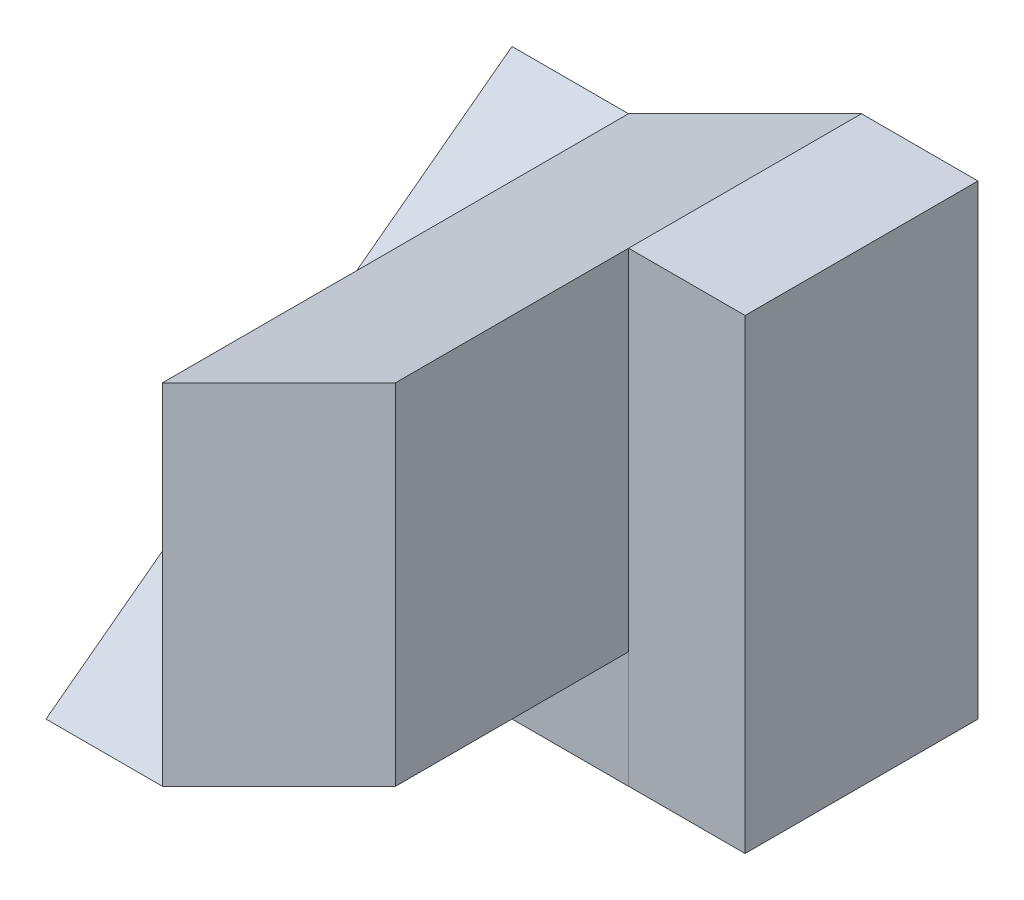
ISO-10303-21;
HEADER;
FILE_DESCRIPTION(('STEP AP214'),'2;1');
FILE_NAME('part.step','',(''),(''),'','','');
FILE_SCHEMA(('AUTOMOTIVE_DESIGN { 1 0 10303 214 1 1 1 1 }'));
ENDSEC;
DATA;
#1=APPLICATION_CONTEXT('core data for automotive mechanical design processes');
#2=APPLICATION_PROTOCOL_DEFINITION('international standard','automotive_design',2000,#1);
#3=PRODUCT_CONTEXT('',#1,'mechanical');
#4=PRODUCT('Part','Part','',(#3));
#5=PRODUCT_RELATED_PRODUCT_CATEGORY('part','',(#4));
#6=PRODUCT_DEFINITION_FORMATION('','',#4);
#7=PRODUCT_DEFINITION_CONTEXT('part definition',#1,'design');
#8=PRODUCT_DEFINITION('design','',#6,#7);
#9=PRODUCT_DEFINITION_SHAPE('','',#8);
#10=(LENGTH_UNIT() NAMED_UNIT(*) SI_UNIT(.MILLI.,.METRE.));
#11=(NAMED_UNIT(*) PLANE_ANGLE_UNIT() SI_UNIT($,.RADIAN.));
#12=(NAMED_UNIT(*) SI_UNIT($,.STERADIAN.) SOLID_ANGLE_UNIT());
#13=UNCERTAINTY_MEASURE_WITH_UNIT(LENGTH_MEASURE(1.E-05),#10,'distance_accuracy_value','');
#14=(GEOMETRIC_REPRESENTATION_CONTEXT(3) GLOBAL_UNCERTAINTY_ASSIGNED_CONTEXT((#13)) GLOBAL_UNIT_ASSIGNED_CONTEXT((#10,
#11,#12)) REPRESENTATION_CONTEXT('',''));
#15=CARTESIAN_POINT('',(0.,0.,0.));
#16=DIRECTION('',(0.,0.,1.));
#17=DIRECTION('',(1.,0.,0.));
#18=AXIS2_PLACEMENT_3D('',#15,#16,#17);
#19=CARTESIAN_POINT('',(3.,0.,0.));
#20=DIRECTION('',(-1.,0.,0.));
#21=DIRECTION('',(0.,0.,1.));
#22=AXIS2_PLACEMENT_3D('',#19,#20,#21);
#23=PLANE('',#22);
#24=DIRECTION('',(0.,-1.,0.));
#25=VECTOR('',#24,1.);
#26=CARTESIAN_POINT('',(3.,0.,1.99922298992306));
#27=LINE('',#26,#25);
#28=CARTESIAN_POINT('',(3.,4.,1.99922298992306));
#29=VERTEX_POINT('',#28);
#30=CARTESIAN_POINT('',(3.,0.,1.99922298992306));
#31=VERTEX_POINT('',#30);
#32=EDGE_CURVE('E50',#29,#31,#27,.T.);
#33=ORIENTED_EDGE('',*,*,#32,.F.);
#34=DIRECTION('',(0.,0.,1.));
#35=VECTOR('',#34,1.);
#36=CARTESIAN_POINT('',(3.,4.,4.));
#37=LINE('',#36,#35);
#38=CARTESIAN_POINT('',(3.,4.,4.));
#39=VERTEX_POINT('',#38);
#40=EDGE_CURVE('E167',#29,#39,#37,.T.);
#41=ORIENTED_EDGE('',*,*,#40,.T.);
#42=DIRECTION('',(0.,-1.,0.));
#43=VECTOR('',#42,1.);
#44=CARTESIAN_POINT('',(3.,0.,4.));
#45=LINE('',#44,#43);
#46=CARTESIAN_POINT('',(3.,0.999999999999999,4.));
#47=VERTEX_POINT('',#46);
#48=EDGE_CURVE('E155',#39,#47,#45,.T.);
#49=ORIENTED_EDGE('',*,*,#48,.T.);
#50=DIRECTION('',(0.,0.,1.));
#51=VECTOR('',#50,1.);
#52=CARTESIAN_POINT('',(3.,0.999999999999999,2.));
#53=LINE('',#52,#51);
#54=CARTESIAN_POINT('',(3.,0.999999999999999,2.));
#55=VERTEX_POINT('',#54);
#56=EDGE_CURVE('E145',#55,#47,#53,.T.);
#57=ORIENTED_EDGE('',*,*,#56,.F.);
#58=DIRECTION('',(0.,1.,0.));
#59=VECTOR('',#58,1.);
#60=CARTESIAN_POINT('',(3.,0.999999999999999,2.));
#61=LINE('',#60,#59);
#62=CARTESIAN_POINT('',(3.,0.,2.));
#63=VERTEX_POINT('',#62);
#64=EDGE_CURVE('E141',#63,#55,#61,.T.);
#65=ORIENTED_EDGE('',*,*,#64,.F.);
#66=DIRECTION('',(0.,0.,-1.));
#67=VECTOR('',#66,1.);
#68=CARTESIAN_POINT('',(3.,0.,4.));
#69=LINE('',#68,#67);
#70=EDGE_CURVE('E158',#63,#31,#69,.T.);
#71=ORIENTED_EDGE('',*,*,#70,.T.);
#72=EDGE_LOOP('',(#33,#41,#49,#57,#65,#71));
#73=FACE_BOUND('',#72,.T.);
#74=ADVANCED_FACE('F33',(#73),#23,.F.);
#75=CARTESIAN_POINT('',(1.,0.,4.));
#76=DIRECTION('',(0.,1.,0.));
#77=DIRECTION('',(0.,0.,1.));
#78=AXIS2_PLACEMENT_3D('',#75,#76,#77);
#79=PLANE('',#78);
#80=DIRECTION('',(1.,0.,0.));
#81=VECTOR('',#80,1.);
#82=CARTESIAN_POINT('',(3.,0.,2.));
#83=LINE('',#82,#81);
#84=CARTESIAN_POINT('',(1.,0.,2.));
#85=VERTEX_POINT('',#84);
#86=EDGE_CURVE('E58',#85,#63,#83,.T.);
#87=ORIENTED_EDGE('',*,*,#86,.F.);
#88=DIRECTION('',(0.,0.,1.));
#89=VECTOR('',#88,1.);
#90=CARTESIAN_POINT('',(1.,0.,2.));
#91=LINE('',#90,#89);
#92=CARTESIAN_POINT('',(1.,0.,4.));
#93=VERTEX_POINT('',#92);
#94=EDGE_CURVE('E147',#85,#93,#91,.T.);
#95=ORIENTED_EDGE('',*,*,#94,.T.);
#96=DIRECTION('',(-1.,0.,0.));
#97=VECTOR('',#96,1.);
#98=CARTESIAN_POINT('',(1.,0.,4.));
#99=LINE('',#98,#97);
#100=CARTESIAN_POINT('',(0.,0.,4.));
#101=VERTEX_POINT('',#100);
#102=EDGE_CURVE('E199',#93,#101,#99,.T.);
#103=ORIENTED_EDGE('',*,*,#102,.T.);
#104=DIRECTION('',(0.,0.,-1.));
#105=VECTOR('',#104,1.);
#106=CARTESIAN_POINT('',(0.,0.,4.));
#107=LINE('',#106,#105);
#108=CARTESIAN_POINT('',(0.,0.,0.));
#109=VERTEX_POINT('',#108);
#110=EDGE_CURVE('E173',#101,#109,#107,.T.);
#111=ORIENTED_EDGE('',*,*,#110,.T.);
#112=DIRECTION('',(-1.,0.,0.));
#113=VECTOR('',#112,1.);
#114=CARTESIAN_POINT('',(1.,0.,0.));
#115=LINE('',#114,#113);
#116=CARTESIAN_POINT('',(4.,0.,0.));
#117=VERTEX_POINT('',#116);
#118=EDGE_CURVE('E11',#117,#109,#115,.T.);
#119=ORIENTED_EDGE('',*,*,#118,.F.);
#120=DIRECTION('',(0.,0.,-1.));
#121=VECTOR('',#120,1.);
#122=CARTESIAN_POINT('',(4.,0.,0.));
#123=LINE('',#122,#121);
#124=CARTESIAN_POINT('',(4.,0.,1.99922298992306));
#125=VERTEX_POINT('',#124);
#126=EDGE_CURVE('E124',#125,#117,#123,.T.);
#127=ORIENTED_EDGE('',*,*,#126,.F.);
#128=DIRECTION('',(-1.,0.,0.));
#129=VECTOR('',#128,1.);
#130=CARTESIAN_POINT('',(4.,0.,1.99922298992306));
#131=LINE('',#130,#129);
#132=EDGE_CURVE('E135',#125,#31,#131,.T.);
#133=ORIENTED_EDGE('',*,*,#132,.T.);
#134=ORIENTED_EDGE('',*,*,#70,.F.);
#135=EDGE_LOOP('',(#87,#95,#103,#111,#119,#127,#133,#134));
#136=FACE_BOUND('',#135,.T.);
#137=ADVANCED_FACE('F35',(#136),#79,.F.);
#138=CARTESIAN_POINT('',(1.,0.,0.));
#139=DIRECTION('',(0.,0.,1.));
#140=DIRECTION('',(1.,0.,0.));
#141=AXIS2_PLACEMENT_3D('',#138,#139,#140);
#142=PLANE('',#141);
#143=DIRECTION('',(-1.,0.,0.));
#144=VECTOR('',#143,1.);
#145=CARTESIAN_POINT('',(1.,3.,0.));
#146=LINE('',#145,#144);
#147=CARTESIAN_POINT('',(1.,3.,0.));
#148=VERTEX_POINT('',#147);
#149=CARTESIAN_POINT('',(0.,3.,0.));
#150=VERTEX_POINT('',#149);
#151=EDGE_CURVE('E42',#148,#150,#146,.T.);
#152=ORIENTED_EDGE('',*,*,#151,.F.);
#153=DIRECTION('',(0.894427190999916,0.447213595499958,0.));
#154=VECTOR('',#153,1.);
#155=CARTESIAN_POINT('',(1.,3.,0.));
#156=LINE('',#155,#154);
#157=CARTESIAN_POINT('',(3.,4.,0.));
#158=VERTEX_POINT('',#157);
#159=EDGE_CURVE('E131',#148,#158,#156,.T.);
#160=ORIENTED_EDGE('',*,*,#159,.T.);
#161=DIRECTION('',(-1.,0.,0.));
#162=VECTOR('',#161,1.);
#163=CARTESIAN_POINT('',(4.,4.,0.));
#164=LINE('',#163,#162);
#165=CARTESIAN_POINT('',(4.,4.,0.));
#166=VERTEX_POINT('',#165);
#167=EDGE_CURVE('E112',#166,#158,#164,.T.);
#168=ORIENTED_EDGE('',*,*,#167,.F.);
#169=DIRECTION('',(0.,1.,0.));
#170=VECTOR('',#169,1.);
#171=CARTESIAN_POINT('',(4.,0.,0.));
#172=LINE('',#171,#170);
#173=EDGE_CURVE('E118',#117,#166,#172,.T.);
#174=ORIENTED_EDGE('',*,*,#173,.F.);
#175=ORIENTED_EDGE('',*,*,#118,.T.);
#176=DIRECTION('',(0.,1.,0.));
#177=VECTOR('',#176,1.);
#178=CARTESIAN_POINT('',(0.,0.,0.));
#179=LINE('',#178,#177);
#180=EDGE_CURVE('E187',#109,#150,#179,.T.);
#181=ORIENTED_EDGE('',*,*,#180,.T.);
#182=EDGE_LOOP('',(#152,#160,#168,#174,#175,#181));
#183=FACE_BOUND('',#182,.T.);
#184=ADVANCED_FACE('F129',(#183),#142,.F.);
#185=CARTESIAN_POINT('',(1.,3.,0.));
#186=DIRECTION('',(0.,-0.8,-0.6));
#187=DIRECTION('',(0.,0.6,-0.8));
#188=AXIS2_PLACEMENT_3D('',#185,#186,#187);
#189=PLANE('',#188);
#190=DIRECTION('',(0.,-0.6,0.8));
#191=VECTOR('',#190,1.);
#192=CARTESIAN_POINT('',(0.,3.,0.));
#193=LINE('',#192,#191);
#194=EDGE_CURVE('E192',#150,#101,#193,.T.);
#195=ORIENTED_EDGE('',*,*,#194,.T.);
#196=ORIENTED_EDGE('',*,*,#102,.F.);
#197=DIRECTION('',(0.,-0.6,0.8));
#198=VECTOR('',#197,1.);
#199=CARTESIAN_POINT('',(1.,3.,0.));
#200=LINE('',#199,#198);
#201=EDGE_CURVE('E198',#148,#93,#200,.T.);
#202=ORIENTED_EDGE('',*,*,#201,.F.);
#203=ORIENTED_EDGE('',*,*,#151,.T.);
#204=EDGE_LOOP('',(#195,#196,#202,#203));
#205=FACE_BOUND('',#204,.T.);
#206=ADVANCED_FACE('F195',(#205),#189,.F.);
#207=CARTESIAN_POINT('',(0.,0.,0.));
#208=DIRECTION('',(1.,0.,0.));
#209=DIRECTION('',(0.,0.,-1.));
#210=AXIS2_PLACEMENT_3D('',#207,#208,#209);
#211=PLANE('',#210);
#212=ORIENTED_EDGE('',*,*,#110,.F.);
#213=ORIENTED_EDGE('',*,*,#194,.F.);
#214=ORIENTED_EDGE('',*,*,#180,.F.);
#215=EDGE_LOOP('',(#212,#213,#214));
#216=FACE_BOUND('',#215,.T.);
#217=ADVANCED_FACE('F201',(#216),#211,.F.);
#218=CARTESIAN_POINT('',(3.,0.,4.));
#219=DIRECTION('',(0.,0.,-1.));
#220=DIRECTION('',(-1.,0.,0.));
#221=AXIS2_PLACEMENT_3D('',#218,#219,#220);
#222=PLANE('',#221);
#223=DIRECTION('',(0.,-1.,0.));
#224=VECTOR('',#223,1.);
#225=CARTESIAN_POINT('',(1.,0.,4.));
#226=LINE('',#225,#224);
#227=CARTESIAN_POINT('',(1.,3.,4.));
#228=VERTEX_POINT('',#227);
#229=EDGE_CURVE('E159',#228,#93,#226,.T.);
#230=ORIENTED_EDGE('',*,*,#229,.T.);
#231=DIRECTION('',(-0.894427190999916,-0.447213595499958,0.));
#232=VECTOR('',#231,1.);
#233=CARTESIAN_POINT('',(1.,0.,4.));
#234=LINE('',#233,#232);
#235=EDGE_CURVE('E133',#47,#93,#234,.T.);
#236=ORIENTED_EDGE('',*,*,#235,.F.);
#237=ORIENTED_EDGE('',*,*,#48,.F.);
#238=DIRECTION('',(0.894427190999916,0.447213595499958,0.));
#239=VECTOR('',#238,1.);
#240=CARTESIAN_POINT('',(3.,4.,4.));
#241=LINE('',#240,#239);
#242=EDGE_CURVE('E150',#228,#39,#241,.T.);
#243=ORIENTED_EDGE('',*,*,#242,.F.);
#244=EDGE_LOOP('',(#230,#236,#237,#243));
#245=FACE_BOUND('',#244,.T.);
#246=ADVANCED_FACE('F218',(#245),#222,.F.);
#247=CARTESIAN_POINT('',(1.,0.,0.));
#248=DIRECTION('',(-1.,0.,0.));
#249=DIRECTION('',(0.,0.,1.));
#250=AXIS2_PLACEMENT_3D('',#247,#248,#249);
#251=PLANE('',#250);
#252=DIRECTION('',(0.,0.,1.));
#253=VECTOR('',#252,1.);
#254=CARTESIAN_POINT('',(1.,3.,2.));
#255=LINE('',#254,#253);
#256=EDGE_CURVE('E154',#148,#228,#255,.T.);
#257=ORIENTED_EDGE('',*,*,#256,.F.);
#258=ORIENTED_EDGE('',*,*,#201,.T.);
#259=ORIENTED_EDGE('',*,*,#229,.F.);
#260=EDGE_LOOP('',(#257,#258,#259));
#261=FACE_BOUND('',#260,.T.);
#262=ADVANCED_FACE('F221',(#261),#251,.T.);
#263=CARTESIAN_POINT('',(3.,4.,2.));
#264=DIRECTION('',(0.447213595499958,-0.894427190999916,0.));
#265=DIRECTION('',(0.894427190999916,0.447213595499958,0.));
#266=AXIS2_PLACEMENT_3D('',#263,#264,#265);
#267=PLANE('',#266);
#268=ORIENTED_EDGE('',*,*,#242,.T.);
#269=ORIENTED_EDGE('',*,*,#40,.F.);
#270=EDGE_CURVE('E171',#158,#29,#37,.T.);
#271=ORIENTED_EDGE('',*,*,#270,.F.);
#272=ORIENTED_EDGE('',*,*,#159,.F.);
#273=ORIENTED_EDGE('',*,*,#256,.T.);
#274=EDGE_LOOP('',(#268,#269,#271,#272,#273));
#275=FACE_BOUND('',#274,.T.);
#276=ADVANCED_FACE('F222',(#275),#267,.F.);
#277=CARTESIAN_POINT('',(1.,0.,2.));
#278=DIRECTION('',(-0.447213595499958,0.894427190999916,0.));
#279=DIRECTION('',(-0.894427190999916,-0.447213595499958,0.));
#280=AXIS2_PLACEMENT_3D('',#277,#278,#279);
#281=PLANE('',#280);
#282=ORIENTED_EDGE('',*,*,#235,.T.);
#283=ORIENTED_EDGE('',*,*,#94,.F.);
#284=DIRECTION('',(-0.894427190999916,-0.447213595499958,0.));
#285=VECTOR('',#284,1.);
#286=CARTESIAN_POINT('',(1.,0.,2.));
#287=LINE('',#286,#285);
#288=EDGE_CURVE('E143',#55,#85,#287,.T.);
#289=ORIENTED_EDGE('',*,*,#288,.F.);
#290=ORIENTED_EDGE('',*,*,#56,.T.);
#291=EDGE_LOOP('',(#282,#283,#289,#290));
#292=FACE_BOUND('',#291,.T.);
#293=ADVANCED_FACE('F226',(#292),#281,.F.);
#294=CARTESIAN_POINT('',(0.,0.,2.));
#295=DIRECTION('',(0.,0.,1.));
#296=DIRECTION('',(1.,0.,0.));
#297=AXIS2_PLACEMENT_3D('',#294,#295,#296);
#298=PLANE('',#297);
#299=ORIENTED_EDGE('',*,*,#86,.T.);
#300=ORIENTED_EDGE('',*,*,#64,.T.);
#301=ORIENTED_EDGE('',*,*,#288,.T.);
#302=EDGE_LOOP('',(#299,#300,#301));
#303=FACE_BOUND('',#302,.T.);
#304=ADVANCED_FACE('F227',(#303),#298,.T.);
#305=CARTESIAN_POINT('',(4.,4.,0.));
#306=DIRECTION('',(0.,-1.,0.));
#307=DIRECTION('',(0.,0.,-1.));
#308=AXIS2_PLACEMENT_3D('',#305,#306,#307);
#309=PLANE('',#308);
#310=ORIENTED_EDGE('',*,*,#270,.T.);
#311=DIRECTION('',(-1.,0.,0.));
#312=VECTOR('',#311,1.);
#313=CARTESIAN_POINT('',(4.,4.,1.99922298992306));
#314=LINE('',#313,#312);
#315=CARTESIAN_POINT('',(4.,4.,1.99922298992306));
#316=VERTEX_POINT('',#315);
#317=EDGE_CURVE('E114',#316,#29,#314,.T.);
#318=ORIENTED_EDGE('',*,*,#317,.F.);
#319=DIRECTION('',(0.,0.,1.));
#320=VECTOR('',#319,1.);
#321=CARTESIAN_POINT('',(4.,4.,0.));
#322=LINE('',#321,#320);
#323=EDGE_CURVE('E107',#166,#316,#322,.T.);
#324=ORIENTED_EDGE('',*,*,#323,.F.);
#325=ORIENTED_EDGE('',*,*,#167,.T.);
#326=EDGE_LOOP('',(#310,#318,#324,#325));
#327=FACE_BOUND('',#326,.T.);
#328=ADVANCED_FACE('F110',(#327),#309,.F.);
#329=CARTESIAN_POINT('',(4.,0.,1.99922298992306));
#330=DIRECTION('',(0.,0.,-1.));
#331=DIRECTION('',(-1.,0.,0.));
#332=AXIS2_PLACEMENT_3D('',#329,#330,#331);
#333=PLANE('',#332);
#334=ORIENTED_EDGE('',*,*,#32,.T.);
#335=ORIENTED_EDGE('',*,*,#132,.F.);
#336=DIRECTION('',(0.,-1.,0.));
#337=VECTOR('',#336,1.);
#338=CARTESIAN_POINT('',(4.,0.,1.99922298992306));
#339=LINE('',#338,#337);
#340=EDGE_CURVE('E117',#316,#125,#339,.T.);
#341=ORIENTED_EDGE('',*,*,#340,.F.);
#342=ORIENTED_EDGE('',*,*,#317,.T.);
#343=EDGE_LOOP('',(#334,#335,#341,#342));
#344=FACE_BOUND('',#343,.T.);
#345=ADVANCED_FACE('F183',(#344),#333,.F.);
#346=CARTESIAN_POINT('',(4.,0.,0.));
#347=DIRECTION('',(1.,0.,0.));
#348=DIRECTION('',(0.,0.,-1.));
#349=AXIS2_PLACEMENT_3D('',#346,#347,#348);
#350=PLANE('',#349);
#351=ORIENTED_EDGE('',*,*,#173,.T.);
#352=ORIENTED_EDGE('',*,*,#323,.T.);
#353=ORIENTED_EDGE('',*,*,#340,.T.);
#354=ORIENTED_EDGE('',*,*,#126,.T.);
#355=EDGE_LOOP('',(#351,#352,#353,#354));
#356=FACE_BOUND('',#355,.T.);
#357=ADVANCED_FACE('F122',(#356),#350,.T.);
#358=CLOSED_SHELL('',(#74,#137,#184,#206,#217,#246,#262,#276,#293,#304,#328,#345,#357));
#359=MANIFOLD_SOLID_BREP('B2',#358);
#360=ADVANCED_BREP_SHAPE_REPRESENTATION('',(#18,#359),#14);
#361=SHAPE_DEFINITION_REPRESENTATION(#9,#360);
ENDSEC;
END-ISO-10303-21;
